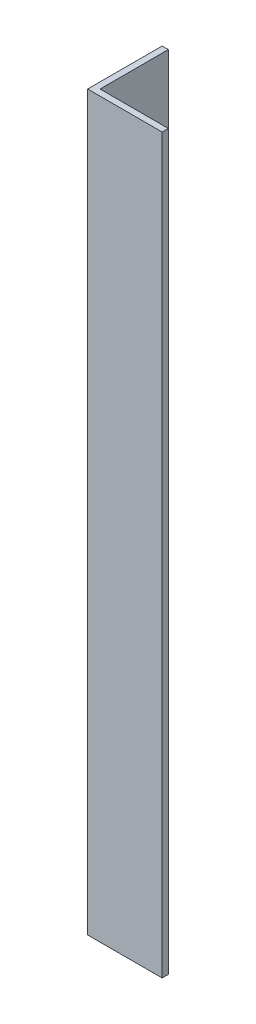
ISO-10303-21;
HEADER;
FILE_DESCRIPTION(('STEP AP214'),'2;1');
FILE_NAME('part.step','',(''),(''),'','','');
FILE_SCHEMA(('AUTOMOTIVE_DESIGN { 1 0 10303 214 1 1 1 1 }'));
ENDSEC;
DATA;
#1=APPLICATION_CONTEXT('core data for automotive mechanical design processes');
#2=APPLICATION_PROTOCOL_DEFINITION('international standard','automotive_design',2000,#1);
#3=PRODUCT_CONTEXT('',#1,'mechanical');
#4=PRODUCT('Part','Part','',(#3));
#5=PRODUCT_RELATED_PRODUCT_CATEGORY('part','',(#4));
#6=PRODUCT_DEFINITION_FORMATION('','',#4);
#7=PRODUCT_DEFINITION_CONTEXT('part definition',#1,'design');
#8=PRODUCT_DEFINITION('design','',#6,#7);
#9=PRODUCT_DEFINITION_SHAPE('','',#8);
#10=(LENGTH_UNIT() NAMED_UNIT(*) SI_UNIT(.MILLI.,.METRE.));
#11=(NAMED_UNIT(*) PLANE_ANGLE_UNIT() SI_UNIT($,.RADIAN.));
#12=(NAMED_UNIT(*) SI_UNIT($,.STERADIAN.) SOLID_ANGLE_UNIT());
#13=UNCERTAINTY_MEASURE_WITH_UNIT(LENGTH_MEASURE(1.E-05),#10,'distance_accuracy_value','');
#14=(GEOMETRIC_REPRESENTATION_CONTEXT(3) GLOBAL_UNCERTAINTY_ASSIGNED_CONTEXT((#13)) GLOBAL_UNIT_ASSIGNED_CONTEXT((#10,
#11,#12)) REPRESENTATION_CONTEXT('',''));
#15=CARTESIAN_POINT('',(0.,0.,0.));
#16=DIRECTION('',(0.,0.,1.));
#17=DIRECTION('',(1.,0.,0.));
#18=AXIS2_PLACEMENT_3D('',#15,#16,#17);
#19=CARTESIAN_POINT('',(0.,187.325,0.));
#20=DIRECTION('',(1.,0.,0.));
#21=DIRECTION('',(0.,0.,-1.));
#22=AXIS2_PLACEMENT_3D('',#19,#20,#21);
#23=PLANE('',#22);
#24=DIRECTION('',(0.,0.,1.));
#25=VECTOR('',#24,1.);
#26=CARTESIAN_POINT('',(0.,0.,0.));
#27=LINE('',#26,#25);
#28=CARTESIAN_POINT('',(0.,0.,-19.05));
#29=VERTEX_POINT('',#28);
#30=CARTESIAN_POINT('',(0.,0.,0.));
#31=VERTEX_POINT('',#30);
#32=EDGE_CURVE('E117',#29,#31,#27,.T.);
#33=ORIENTED_EDGE('',*,*,#32,.T.);
#34=DIRECTION('',(0.,-1.,0.));
#35=VECTOR('',#34,1.);
#36=CARTESIAN_POINT('',(0.,187.325,0.));
#37=LINE('',#36,#35);
#38=CARTESIAN_POINT('',(0.,187.325,0.));
#39=VERTEX_POINT('',#38);
#40=EDGE_CURVE('E11',#39,#31,#37,.T.);
#41=ORIENTED_EDGE('',*,*,#40,.F.);
#42=DIRECTION('',(0.,0.,1.));
#43=VECTOR('',#42,1.);
#44=CARTESIAN_POINT('',(0.,187.325,0.));
#45=LINE('',#44,#43);
#46=CARTESIAN_POINT('',(0.,187.325,-19.05));
#47=VERTEX_POINT('',#46);
#48=EDGE_CURVE('E127',#47,#39,#45,.T.);
#49=ORIENTED_EDGE('',*,*,#48,.F.);
#50=DIRECTION('',(0.,-1.,0.));
#51=VECTOR('',#50,1.);
#52=CARTESIAN_POINT('',(0.,187.325,-19.05));
#53=LINE('',#52,#51);
#54=EDGE_CURVE('E113',#47,#29,#53,.T.);
#55=ORIENTED_EDGE('',*,*,#54,.T.);
#56=EDGE_LOOP('',(#33,#41,#49,#55));
#57=FACE_BOUND('',#56,.T.);
#58=ADVANCED_FACE('F33',(#57),#23,.F.);
#59=CARTESIAN_POINT('',(0.,187.325,0.));
#60=DIRECTION('',(0.,0.,-1.));
#61=DIRECTION('',(-1.,0.,0.));
#62=AXIS2_PLACEMENT_3D('',#59,#60,#61);
#63=PLANE('',#62);
#64=DIRECTION('',(1.,0.,0.));
#65=VECTOR('',#64,1.);
#66=CARTESIAN_POINT('',(0.,0.,0.));
#67=LINE('',#66,#65);
#68=CARTESIAN_POINT('',(19.05,0.,0.));
#69=VERTEX_POINT('',#68);
#70=EDGE_CURVE('E120',#31,#69,#67,.T.);
#71=ORIENTED_EDGE('',*,*,#70,.T.);
#72=DIRECTION('',(0.,-1.,0.));
#73=VECTOR('',#72,1.);
#74=CARTESIAN_POINT('',(19.05,187.325,0.));
#75=LINE('',#74,#73);
#76=CARTESIAN_POINT('',(19.05,187.325,0.));
#77=VERTEX_POINT('',#76);
#78=EDGE_CURVE('E41',#77,#69,#75,.T.);
#79=ORIENTED_EDGE('',*,*,#78,.F.);
#80=DIRECTION('',(1.,0.,0.));
#81=VECTOR('',#80,1.);
#82=CARTESIAN_POINT('',(0.,187.325,0.));
#83=LINE('',#82,#81);
#84=EDGE_CURVE('E86',#39,#77,#83,.T.);
#85=ORIENTED_EDGE('',*,*,#84,.F.);
#86=ORIENTED_EDGE('',*,*,#40,.T.);
#87=EDGE_LOOP('',(#71,#79,#85,#86));
#88=FACE_BOUND('',#87,.T.);
#89=ADVANCED_FACE('F151',(#88),#63,.F.);
#90=CARTESIAN_POINT('',(19.05,187.325,-1.5875));
#91=DIRECTION('',(-1.,0.,0.));
#92=DIRECTION('',(0.,0.,1.));
#93=AXIS2_PLACEMENT_3D('',#90,#91,#92);
#94=PLANE('',#93);
#95=DIRECTION('',(0.,0.,-1.));
#96=VECTOR('',#95,1.);
#97=CARTESIAN_POINT('',(19.05,0.,-1.5875));
#98=LINE('',#97,#96);
#99=CARTESIAN_POINT('',(19.05,0.,-1.5875));
#100=VERTEX_POINT('',#99);
#101=EDGE_CURVE('E122',#69,#100,#98,.T.);
#102=ORIENTED_EDGE('',*,*,#101,.T.);
#103=DIRECTION('',(0.,-1.,0.));
#104=VECTOR('',#103,1.);
#105=CARTESIAN_POINT('',(19.05,187.325,-1.5875));
#106=LINE('',#105,#104);
#107=CARTESIAN_POINT('',(19.05,187.325,-1.5875));
#108=VERTEX_POINT('',#107);
#109=EDGE_CURVE('E108',#108,#100,#106,.T.);
#110=ORIENTED_EDGE('',*,*,#109,.F.);
#111=DIRECTION('',(0.,0.,-1.));
#112=VECTOR('',#111,1.);
#113=CARTESIAN_POINT('',(19.05,187.325,-1.5875));
#114=LINE('',#113,#112);
#115=EDGE_CURVE('E99',#77,#108,#114,.T.);
#116=ORIENTED_EDGE('',*,*,#115,.F.);
#117=ORIENTED_EDGE('',*,*,#78,.T.);
#118=EDGE_LOOP('',(#102,#110,#116,#117));
#119=FACE_BOUND('',#118,.T.);
#120=ADVANCED_FACE('F133',(#119),#94,.F.);
#121=CARTESIAN_POINT('',(1.5875,187.325,-1.5875));
#122=DIRECTION('',(0.,0.,1.));
#123=DIRECTION('',(1.,0.,0.));
#124=AXIS2_PLACEMENT_3D('',#121,#122,#123);
#125=PLANE('',#124);
#126=DIRECTION('',(-1.,0.,0.));
#127=VECTOR('',#126,1.);
#128=CARTESIAN_POINT('',(1.5875,0.,-1.5875));
#129=LINE('',#128,#127);
#130=CARTESIAN_POINT('',(1.5875,0.,-1.5875));
#131=VERTEX_POINT('',#130);
#132=EDGE_CURVE('E107',#100,#131,#129,.T.);
#133=ORIENTED_EDGE('',*,*,#132,.T.);
#134=DIRECTION('',(0.,-1.,0.));
#135=VECTOR('',#134,1.);
#136=CARTESIAN_POINT('',(1.5875,187.325,-1.5875));
#137=LINE('',#136,#135);
#138=CARTESIAN_POINT('',(1.5875,187.325,-1.5875));
#139=VERTEX_POINT('',#138);
#140=EDGE_CURVE('E104',#139,#131,#137,.T.);
#141=ORIENTED_EDGE('',*,*,#140,.F.);
#142=DIRECTION('',(-1.,0.,0.));
#143=VECTOR('',#142,1.);
#144=CARTESIAN_POINT('',(1.5875,187.325,-1.5875));
#145=LINE('',#144,#143);
#146=EDGE_CURVE('E93',#108,#139,#145,.T.);
#147=ORIENTED_EDGE('',*,*,#146,.F.);
#148=ORIENTED_EDGE('',*,*,#109,.T.);
#149=EDGE_LOOP('',(#133,#141,#147,#148));
#150=FACE_BOUND('',#149,.T.);
#151=ADVANCED_FACE('F105',(#150),#125,.F.);
#152=CARTESIAN_POINT('',(1.5875,187.325,-1.5875));
#153=DIRECTION('',(-1.,0.,0.));
#154=DIRECTION('',(0.,0.,1.));
#155=AXIS2_PLACEMENT_3D('',#152,#153,#154);
#156=PLANE('',#155);
#157=DIRECTION('',(0.,0.,-1.));
#158=VECTOR('',#157,1.);
#159=CARTESIAN_POINT('',(1.5875,0.,-1.5875));
#160=LINE('',#159,#158);
#161=CARTESIAN_POINT('',(1.5875,0.,-19.05));
#162=VERTEX_POINT('',#161);
#163=EDGE_CURVE('E72',#131,#162,#160,.T.);
#164=ORIENTED_EDGE('',*,*,#163,.T.);
#165=DIRECTION('',(0.,-1.,0.));
#166=VECTOR('',#165,1.);
#167=CARTESIAN_POINT('',(1.5875,187.325,-19.05));
#168=LINE('',#167,#166);
#169=CARTESIAN_POINT('',(1.5875,187.325,-19.05));
#170=VERTEX_POINT('',#169);
#171=EDGE_CURVE('E109',#170,#162,#168,.T.);
#172=ORIENTED_EDGE('',*,*,#171,.F.);
#173=DIRECTION('',(0.,0.,-1.));
#174=VECTOR('',#173,1.);
#175=CARTESIAN_POINT('',(1.5875,187.325,-1.5875));
#176=LINE('',#175,#174);
#177=EDGE_CURVE('E97',#139,#170,#176,.T.);
#178=ORIENTED_EDGE('',*,*,#177,.F.);
#179=ORIENTED_EDGE('',*,*,#140,.T.);
#180=EDGE_LOOP('',(#164,#172,#178,#179));
#181=FACE_BOUND('',#180,.T.);
#182=ADVANCED_FACE('F111',(#181),#156,.F.);
#183=CARTESIAN_POINT('',(0.,187.325,-19.05));
#184=DIRECTION('',(0.,0.,1.));
#185=DIRECTION('',(1.,0.,0.));
#186=AXIS2_PLACEMENT_3D('',#183,#184,#185);
#187=PLANE('',#186);
#188=DIRECTION('',(-1.,0.,0.));
#189=VECTOR('',#188,1.);
#190=CARTESIAN_POINT('',(0.,0.,-19.05));
#191=LINE('',#190,#189);
#192=EDGE_CURVE('E78',#162,#29,#191,.T.);
#193=ORIENTED_EDGE('',*,*,#192,.T.);
#194=ORIENTED_EDGE('',*,*,#54,.F.);
#195=DIRECTION('',(-1.,0.,0.));
#196=VECTOR('',#195,1.);
#197=CARTESIAN_POINT('',(0.,187.325,-19.05));
#198=LINE('',#197,#196);
#199=EDGE_CURVE('E49',#170,#47,#198,.T.);
#200=ORIENTED_EDGE('',*,*,#199,.F.);
#201=ORIENTED_EDGE('',*,*,#171,.T.);
#202=EDGE_LOOP('',(#193,#194,#200,#201));
#203=FACE_BOUND('',#202,.T.);
#204=ADVANCED_FACE('F140',(#203),#187,.F.);
#205=CARTESIAN_POINT('',(0.,187.325,0.));
#206=DIRECTION('',(0.,-1.,0.));
#207=DIRECTION('',(0.,0.,-1.));
#208=AXIS2_PLACEMENT_3D('',#205,#206,#207);
#209=PLANE('',#208);
#210=ORIENTED_EDGE('',*,*,#48,.T.);
#211=ORIENTED_EDGE('',*,*,#84,.T.);
#212=ORIENTED_EDGE('',*,*,#115,.T.);
#213=ORIENTED_EDGE('',*,*,#146,.T.);
#214=ORIENTED_EDGE('',*,*,#177,.T.);
#215=ORIENTED_EDGE('',*,*,#199,.T.);
#216=EDGE_LOOP('',(#210,#211,#212,#213,#214,#215));
#217=FACE_BOUND('',#216,.T.);
#218=ADVANCED_FACE('F95',(#217),#209,.F.);
#219=CARTESIAN_POINT('',(0.,0.,0.));
#220=DIRECTION('',(0.,-1.,0.));
#221=DIRECTION('',(0.,0.,-1.));
#222=AXIS2_PLACEMENT_3D('',#219,#220,#221);
#223=PLANE('',#222);
#224=ORIENTED_EDGE('',*,*,#32,.F.);
#225=ORIENTED_EDGE('',*,*,#192,.F.);
#226=ORIENTED_EDGE('',*,*,#163,.F.);
#227=ORIENTED_EDGE('',*,*,#132,.F.);
#228=ORIENTED_EDGE('',*,*,#101,.F.);
#229=ORIENTED_EDGE('',*,*,#70,.F.);
#230=EDGE_LOOP('',(#224,#225,#226,#227,#228,#229));
#231=FACE_BOUND('',#230,.T.);
#232=ADVANCED_FACE('F136',(#231),#223,.T.);
#233=CLOSED_SHELL('',(#58,#89,#120,#151,#182,#204,#218,#232));
#234=MANIFOLD_SOLID_BREP('B2',#233);
#235=ADVANCED_BREP_SHAPE_REPRESENTATION('',(#18,#234),#14);
#236=SHAPE_DEFINITION_REPRESENTATION(#9,#235);
ENDSEC;
END-ISO-10303-21;
